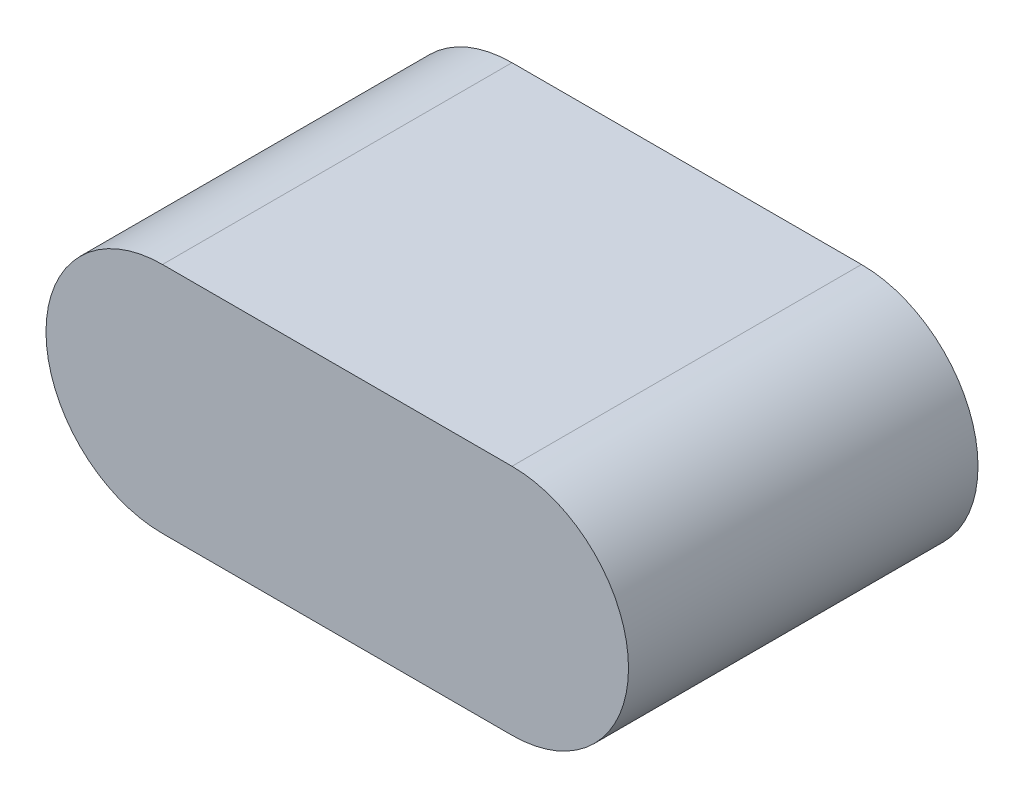
ISO-10303-21;
HEADER;
FILE_DESCRIPTION(('STEP AP214'),'2;1');
FILE_NAME('part.step','',(''),(''),'','','');
FILE_SCHEMA(('AUTOMOTIVE_DESIGN { 1 0 10303 214 1 1 1 1 }'));
ENDSEC;
DATA;
#1=APPLICATION_CONTEXT('core data for automotive mechanical design processes');
#2=APPLICATION_PROTOCOL_DEFINITION('international standard','automotive_design',2000,#1);
#3=PRODUCT_CONTEXT('',#1,'mechanical');
#4=PRODUCT('Part','Part','',(#3));
#5=PRODUCT_RELATED_PRODUCT_CATEGORY('part','',(#4));
#6=PRODUCT_DEFINITION_FORMATION('','',#4);
#7=PRODUCT_DEFINITION_CONTEXT('part definition',#1,'design');
#8=PRODUCT_DEFINITION('design','',#6,#7);
#9=PRODUCT_DEFINITION_SHAPE('','',#8);
#10=(LENGTH_UNIT() NAMED_UNIT(*) SI_UNIT(.MILLI.,.METRE.));
#11=(NAMED_UNIT(*) PLANE_ANGLE_UNIT() SI_UNIT($,.RADIAN.));
#12=(NAMED_UNIT(*) SI_UNIT($,.STERADIAN.) SOLID_ANGLE_UNIT());
#13=UNCERTAINTY_MEASURE_WITH_UNIT(LENGTH_MEASURE(1.E-05),#10,'distance_accuracy_value','');
#14=(GEOMETRIC_REPRESENTATION_CONTEXT(3) GLOBAL_UNCERTAINTY_ASSIGNED_CONTEXT((#13)) GLOBAL_UNIT_ASSIGNED_CONTEXT((#10,
#11,#12)) REPRESENTATION_CONTEXT('',''));
#15=CARTESIAN_POINT('',(0.,0.,0.));
#16=DIRECTION('',(0.,0.,1.));
#17=DIRECTION('',(1.,0.,0.));
#18=AXIS2_PLACEMENT_3D('',#15,#16,#17);
#19=CARTESIAN_POINT('',(-3.51895819844644,0.,6.));
#20=DIRECTION('',(0.,0.,-1.));
#21=DIRECTION('',(-1.,0.,0.));
#22=AXIS2_PLACEMENT_3D('',#19,#20,#21);
#23=CYLINDRICAL_SURFACE('',#22,2.);
#24=CARTESIAN_POINT('',(-3.51895819844644,0.,0.));
#25=DIRECTION('',(0.,0.,1.));
#26=DIRECTION('',(1.,0.,0.));
#27=AXIS2_PLACEMENT_3D('',#24,#25,#26);
#28=CIRCLE('',#27,2.);
#29=CARTESIAN_POINT('',(-3.51895819844644,2.,0.));
#30=VERTEX_POINT('',#29);
#31=CARTESIAN_POINT('',(-3.51895819844644,-2.,0.));
#32=VERTEX_POINT('',#31);
#33=EDGE_CURVE('E107',#30,#32,#28,.T.);
#34=ORIENTED_EDGE('',*,*,#33,.T.);
#35=DIRECTION('',(0.,0.,-1.));
#36=VECTOR('',#35,1.);
#37=CARTESIAN_POINT('',(-3.51895819844644,-2.,6.));
#38=LINE('',#37,#36);
#39=CARTESIAN_POINT('',(-3.51895819844644,-2.,6.));
#40=VERTEX_POINT('',#39);
#41=EDGE_CURVE('E11',#40,#32,#38,.T.);
#42=ORIENTED_EDGE('',*,*,#41,.F.);
#43=CARTESIAN_POINT('',(-3.51895819844644,0.,6.));
#44=DIRECTION('',(0.,0.,1.));
#45=DIRECTION('',(1.,0.,0.));
#46=AXIS2_PLACEMENT_3D('',#43,#44,#45);
#47=CIRCLE('',#46,2.);
#48=CARTESIAN_POINT('',(-3.51895819844644,2.,6.));
#49=VERTEX_POINT('',#48);
#50=EDGE_CURVE('E91',#49,#40,#47,.T.);
#51=ORIENTED_EDGE('',*,*,#50,.F.);
#52=DIRECTION('',(0.,0.,-1.));
#53=VECTOR('',#52,1.);
#54=CARTESIAN_POINT('',(-3.51895819844644,2.,6.));
#55=LINE('',#54,#53);
#56=EDGE_CURVE('E103',#49,#30,#55,.T.);
#57=ORIENTED_EDGE('',*,*,#56,.T.);
#58=EDGE_LOOP('',(#34,#42,#51,#57));
#59=FACE_BOUND('',#58,.T.);
#60=ADVANCED_FACE('F39',(#59),#23,.T.);
#61=CARTESIAN_POINT('',(-3.51895819844644,-2.,6.));
#62=DIRECTION('',(0.,1.,0.));
#63=DIRECTION('',(0.,0.,1.));
#64=AXIS2_PLACEMENT_3D('',#61,#62,#63);
#65=PLANE('',#64);
#66=DIRECTION('',(1.,0.,0.));
#67=VECTOR('',#66,1.);
#68=CARTESIAN_POINT('',(-3.51895819844644,-2.,0.));
#69=LINE('',#68,#67);
#70=CARTESIAN_POINT('',(2.48104180155356,-2.,0.));
#71=VERTEX_POINT('',#70);
#72=EDGE_CURVE('E96',#32,#71,#69,.T.);
#73=ORIENTED_EDGE('',*,*,#72,.T.);
#74=DIRECTION('',(0.,0.,-1.));
#75=VECTOR('',#74,1.);
#76=CARTESIAN_POINT('',(2.48104180155356,-2.,6.));
#77=LINE('',#76,#75);
#78=CARTESIAN_POINT('',(2.48104180155356,-2.,6.));
#79=VERTEX_POINT('',#78);
#80=EDGE_CURVE('E48',#79,#71,#77,.T.);
#81=ORIENTED_EDGE('',*,*,#80,.F.);
#82=DIRECTION('',(1.,0.,0.));
#83=VECTOR('',#82,1.);
#84=CARTESIAN_POINT('',(-3.51895819844644,-2.,6.));
#85=LINE('',#84,#83);
#86=EDGE_CURVE('E86',#40,#79,#85,.T.);
#87=ORIENTED_EDGE('',*,*,#86,.F.);
#88=ORIENTED_EDGE('',*,*,#41,.T.);
#89=EDGE_LOOP('',(#73,#81,#87,#88));
#90=FACE_BOUND('',#89,.T.);
#91=ADVANCED_FACE('F95',(#90),#65,.F.);
#92=CARTESIAN_POINT('',(2.48104180155356,0.,6.));
#93=DIRECTION('',(0.,0.,-1.));
#94=DIRECTION('',(-1.,0.,0.));
#95=AXIS2_PLACEMENT_3D('',#92,#93,#94);
#96=CYLINDRICAL_SURFACE('',#95,2.);
#97=CARTESIAN_POINT('',(2.48104180155356,0.,0.));
#98=DIRECTION('',(0.,0.,1.));
#99=DIRECTION('',(1.,0.,0.));
#100=AXIS2_PLACEMENT_3D('',#97,#98,#99);
#101=CIRCLE('',#100,2.);
#102=CARTESIAN_POINT('',(2.48104180155356,2.,0.));
#103=VERTEX_POINT('',#102);
#104=EDGE_CURVE('E73',#71,#103,#101,.T.);
#105=ORIENTED_EDGE('',*,*,#104,.T.);
#106=DIRECTION('',(0.,0.,-1.));
#107=VECTOR('',#106,1.);
#108=CARTESIAN_POINT('',(2.48104180155356,2.,6.));
#109=LINE('',#108,#107);
#110=CARTESIAN_POINT('',(2.48104180155356,2.,6.));
#111=VERTEX_POINT('',#110);
#112=EDGE_CURVE('E98',#111,#103,#109,.T.);
#113=ORIENTED_EDGE('',*,*,#112,.F.);
#114=CARTESIAN_POINT('',(2.48104180155356,0.,6.));
#115=DIRECTION('',(0.,0.,1.));
#116=DIRECTION('',(1.,0.,0.));
#117=AXIS2_PLACEMENT_3D('',#114,#115,#116);
#118=CIRCLE('',#117,2.);
#119=EDGE_CURVE('E89',#79,#111,#118,.T.);
#120=ORIENTED_EDGE('',*,*,#119,.F.);
#121=ORIENTED_EDGE('',*,*,#80,.T.);
#122=EDGE_LOOP('',(#105,#113,#120,#121));
#123=FACE_BOUND('',#122,.T.);
#124=ADVANCED_FACE('F99',(#123),#96,.T.);
#125=CARTESIAN_POINT('',(-3.51895819844644,2.,6.));
#126=DIRECTION('',(0.,-1.,0.));
#127=DIRECTION('',(0.,0.,-1.));
#128=AXIS2_PLACEMENT_3D('',#125,#126,#127);
#129=PLANE('',#128);
#130=DIRECTION('',(-1.,0.,0.));
#131=VECTOR('',#130,1.);
#132=CARTESIAN_POINT('',(-3.51895819844644,2.,0.));
#133=LINE('',#132,#131);
#134=EDGE_CURVE('E79',#103,#30,#133,.T.);
#135=ORIENTED_EDGE('',*,*,#134,.T.);
#136=ORIENTED_EDGE('',*,*,#56,.F.);
#137=DIRECTION('',(-1.,0.,0.));
#138=VECTOR('',#137,1.);
#139=CARTESIAN_POINT('',(-3.51895819844644,2.,6.));
#140=LINE('',#139,#138);
#141=EDGE_CURVE('E56',#111,#49,#140,.T.);
#142=ORIENTED_EDGE('',*,*,#141,.F.);
#143=ORIENTED_EDGE('',*,*,#112,.T.);
#144=EDGE_LOOP('',(#135,#136,#142,#143));
#145=FACE_BOUND('',#144,.T.);
#146=ADVANCED_FACE('F120',(#145),#129,.F.);
#147=CARTESIAN_POINT('',(-3.51895819844644,0.,6.));
#148=DIRECTION('',(0.,0.,1.));
#149=DIRECTION('',(1.,0.,0.));
#150=AXIS2_PLACEMENT_3D('',#147,#148,#149);
#151=PLANE('',#150);
#152=ORIENTED_EDGE('',*,*,#50,.T.);
#153=ORIENTED_EDGE('',*,*,#86,.T.);
#154=ORIENTED_EDGE('',*,*,#119,.T.);
#155=ORIENTED_EDGE('',*,*,#141,.T.);
#156=EDGE_LOOP('',(#152,#153,#154,#155));
#157=FACE_BOUND('',#156,.T.);
#158=ADVANCED_FACE('F87',(#157),#151,.T.);
#159=CARTESIAN_POINT('',(-3.51895819844644,0.,0.));
#160=DIRECTION('',(0.,0.,1.));
#161=DIRECTION('',(1.,0.,0.));
#162=AXIS2_PLACEMENT_3D('',#159,#160,#161);
#163=PLANE('',#162);
#164=ORIENTED_EDGE('',*,*,#33,.F.);
#165=ORIENTED_EDGE('',*,*,#134,.F.);
#166=ORIENTED_EDGE('',*,*,#104,.F.);
#167=ORIENTED_EDGE('',*,*,#72,.F.);
#168=EDGE_LOOP('',(#164,#165,#166,#167));
#169=FACE_BOUND('',#168,.T.);
#170=ADVANCED_FACE('F123',(#169),#163,.F.);
#171=CLOSED_SHELL('',(#60,#91,#124,#146,#158,#170));
#172=MANIFOLD_SOLID_BREP('B2',#171);
#173=ADVANCED_BREP_SHAPE_REPRESENTATION('',(#18,#172),#14);
#174=SHAPE_DEFINITION_REPRESENTATION(#9,#173);
ENDSEC;
END-ISO-10303-21;
